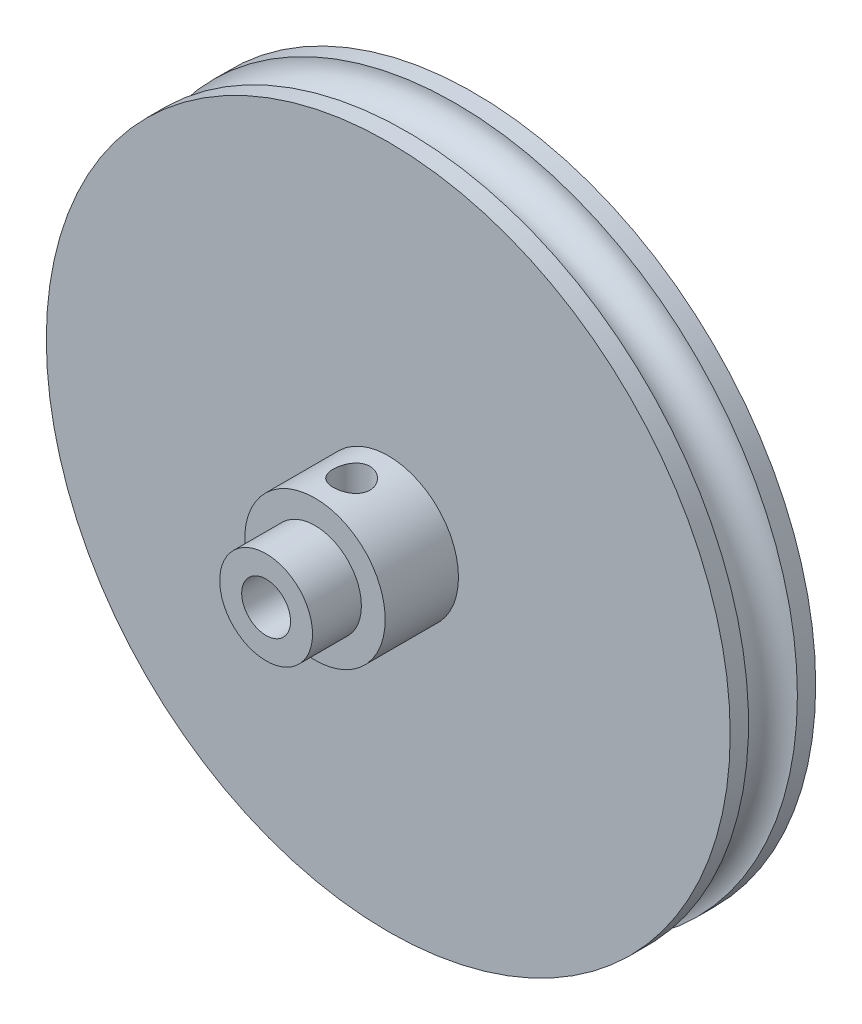
ISO-10303-21;
HEADER;
FILE_DESCRIPTION(('STEP AP214'),'2;1');
FILE_NAME('part.step','',(''),(''),'','','');
FILE_SCHEMA(('AUTOMOTIVE_DESIGN { 1 0 10303 214 1 1 1 1 }'));
ENDSEC;
DATA;
#1=APPLICATION_CONTEXT('core data for automotive mechanical design processes');
#2=APPLICATION_PROTOCOL_DEFINITION('international standard','automotive_design',2000,#1);
#3=PRODUCT_CONTEXT('',#1,'mechanical');
#4=PRODUCT('Part','Part','',(#3));
#5=PRODUCT_RELATED_PRODUCT_CATEGORY('part','',(#4));
#6=PRODUCT_DEFINITION_FORMATION('','',#4);
#7=PRODUCT_DEFINITION_CONTEXT('part definition',#1,'design');
#8=PRODUCT_DEFINITION('design','',#6,#7);
#9=PRODUCT_DEFINITION_SHAPE('','',#8);
#10=(LENGTH_UNIT() NAMED_UNIT(*) SI_UNIT(.MILLI.,.METRE.));
#11=(NAMED_UNIT(*) PLANE_ANGLE_UNIT() SI_UNIT($,.RADIAN.));
#12=(NAMED_UNIT(*) SI_UNIT($,.STERADIAN.) SOLID_ANGLE_UNIT());
#13=UNCERTAINTY_MEASURE_WITH_UNIT(LENGTH_MEASURE(1.E-05),#10,'distance_accuracy_value','');
#14=(GEOMETRIC_REPRESENTATION_CONTEXT(3) GLOBAL_UNCERTAINTY_ASSIGNED_CONTEXT((#13)) GLOBAL_UNIT_ASSIGNED_CONTEXT((#10,
#11,#12)) REPRESENTATION_CONTEXT('',''));
#15=CARTESIAN_POINT('',(0.,0.,0.));
#16=DIRECTION('',(0.,0.,1.));
#17=DIRECTION('',(1.,0.,0.));
#18=AXIS2_PLACEMENT_3D('',#15,#16,#17);
#19=CARTESIAN_POINT('',(0.,0.,0.));
#20=DIRECTION('',(0.,0.,1.));
#21=DIRECTION('',(1.,0.,0.));
#22=AXIS2_PLACEMENT_3D('',#19,#20,#21);
#23=CYLINDRICAL_SURFACE('',#22,2.);
#24=CARTESIAN_POINT('',(0.,0.,0.));
#25=DIRECTION('',(0.,0.,1.));
#26=DIRECTION('',(1.,0.,0.));
#27=AXIS2_PLACEMENT_3D('',#24,#25,#26);
#28=CIRCLE('',#27,2.);
#29=CARTESIAN_POINT('',(2.,0.,0.));
#30=VERTEX_POINT('',#29);
#31=EDGE_CURVE('E76',#30,#30,#28,.T.);
#32=ORIENTED_EDGE('',*,*,#31,.F.);
#33=EDGE_LOOP('',(#32));
#34=FACE_BOUND('',#33,.T.);
#35=CARTESIAN_POINT('',(0.,0.,17.));
#36=DIRECTION('',(0.,0.,1.));
#37=DIRECTION('',(1.,0.,0.));
#38=AXIS2_PLACEMENT_3D('',#35,#36,#37);
#39=CIRCLE('',#38,2.);
#40=CARTESIAN_POINT('',(2.,0.,17.));
#41=VERTEX_POINT('',#40);
#42=EDGE_CURVE('E64',#41,#41,#39,.T.);
#43=ORIENTED_EDGE('',*,*,#42,.T.);
#44=EDGE_LOOP('',(#43));
#45=FACE_BOUND('',#44,.T.);
#46=CARTESIAN_POINT('',(0.,2.,8.5));
#47=CARTESIAN_POINT('',(-0.0732207358411543,1.99999540196395,8.50000479201202));
#48=CARTESIAN_POINT('',(-0.146561062021485,1.99593645526274,8.5054050243745));
#49=CARTESIAN_POINT('',(-0.290936396286467,1.98006607281083,8.52666706341016));
#50=CARTESIAN_POINT('',(-0.361965136229004,1.96823514679854,8.54255517165006));
#51=CARTESIAN_POINT('',(-0.499234626631249,1.9379567495606,8.58371290928377));
#52=CARTESIAN_POINT('',(-0.565501615403736,1.91954951932009,8.60892551356918));
#53=CARTESIAN_POINT('',(-0.692422335520752,1.87750556721694,8.66754234418723));
#54=CARTESIAN_POINT('',(-0.753077701796332,1.85387037535483,8.70094417419352));
#55=CARTESIAN_POINT('',(-0.873465937590145,1.80049544543983,8.77826301159082));
#56=CARTESIAN_POINT('',(-0.932593229272032,1.77039308548439,8.82286732933407));
#57=CARTESIAN_POINT('',(-1.04302716767671,1.70767017883378,8.91949583736117));
#58=CARTESIAN_POINT('',(-1.09432148272226,1.67504578078609,8.97153148279983));
#59=CARTESIAN_POINT('',(-1.19837161436623,1.6027112365199,9.09358295327837));
#60=CARTESIAN_POINT('',(-1.24930578421204,1.56290854864639,9.1651036771217));
#61=CARTESIAN_POINT('',(-1.33861998176348,1.48711444664135,9.31745101236655));
#62=CARTESIAN_POINT('',(-1.37701716983077,1.45111786883675,9.39826469700031));
#63=CARTESIAN_POINT('',(-1.42880627811788,1.39977155180179,9.53950283867623));
#64=CARTESIAN_POINT('',(-1.44625674456539,1.38157751186733,9.59739069712838));
#65=CARTESIAN_POINT('',(-1.47420672564844,1.35171594150685,9.71639273478492));
#66=CARTESIAN_POINT('',(-1.48472215355267,1.34003347910832,9.77749917787479));
#67=CARTESIAN_POINT('',(-1.49812822141445,1.32503759684553,9.90218258553077));
#68=CARTESIAN_POINT('',(-1.50094954854207,1.32180026676597,9.96577680672405));
#69=CARTESIAN_POINT('',(-1.49848213241869,1.32459531776068,10.0926149108816));
#70=CARTESIAN_POINT('',(-1.49319048157349,1.33063102218113,10.1558586600874));
#71=CARTESIAN_POINT('',(-1.47597739291882,1.34967623262519,10.2731913474258));
#72=CARTESIAN_POINT('',(-1.46482486380817,1.36187157059871,10.3275363710462));
#73=CARTESIAN_POINT('',(-1.43705671120732,1.39114192844939,10.4334388787209));
#74=CARTESIAN_POINT('',(-1.42043583681172,1.40822163640769,10.4849936278236));
#75=CARTESIAN_POINT('',(-1.37033064172535,1.45741769294306,10.6162563866341));
#76=CARTESIAN_POINT('',(-1.3328014849398,1.49225649139233,10.6934004166435));
#77=CARTESIAN_POINT('',(-1.24618023314519,1.56533298145196,10.8391965238691));
#78=CARTESIAN_POINT('',(-1.19706004255878,1.60357878886109,10.9078273392547));
#79=CARTESIAN_POINT('',(-1.08651604102135,1.68051672313145,11.0377533904037));
#80=CARTESIAN_POINT('',(-1.02481375526037,1.71919586730239,11.0988206068815));
#81=CARTESIAN_POINT('',(-0.89042252170959,1.79248037980972,11.2102636467812));
#82=CARTESIAN_POINT('',(-0.817755054293757,1.8270934826376,11.2606599202304));
#83=CARTESIAN_POINT('',(-0.677902080454143,1.88279726073643,11.3399807992403));
#84=CARTESIAN_POINT('',(-0.61253987018562,1.90520770945008,11.3711845942158));
#85=CARTESIAN_POINT('',(-0.476352173202086,1.94372904416948,11.4242248804639));
#86=CARTESIAN_POINT('',(-0.405530141063766,1.95984387504352,11.4460672384993));
#87=CARTESIAN_POINT('',(-0.259676232483518,1.98445588635989,11.4792533628864));
#88=CARTESIAN_POINT('',(-0.184621281405943,1.99290592971749,11.4905321789386));
#89=CARTESIAN_POINT('',(-0.0332012397969171,2.00115883659445,11.5015495973717));
#90=CARTESIAN_POINT('',(0.0431632843727236,2.00096534845408,11.5012930686954));
#91=CARTESIAN_POINT('',(0.186804217329625,1.99242547175873,11.4898891307268));
#92=CARTESIAN_POINT('',(0.254222327546133,1.98490086600401,11.4798394631113));
#93=CARTESIAN_POINT('',(0.386110670609118,1.96351320201588,11.4510262199921));
#94=CARTESIAN_POINT('',(0.450580272987261,1.94964879507262,11.4322607903106));
#95=CARTESIAN_POINT('',(0.577416779689769,1.91599830683313,11.3861124694069));
#96=CARTESIAN_POINT('',(0.639629172536139,1.89602050290193,11.3584488185726));
#97=CARTESIAN_POINT('',(0.758518527043073,1.85166985411963,11.2958275445744));
#98=CARTESIAN_POINT('',(0.815194721336403,1.82729640132068,11.2608689123603));
#99=CARTESIAN_POINT('',(0.931511626319037,1.77119146886499,11.1782167535894));
#100=CARTESIAN_POINT('',(0.990066762698702,1.73891095025037,11.1293714605625));
#101=CARTESIAN_POINT('',(1.09871974855854,1.67238952874785,11.0239912474116));
#102=CARTESIAN_POINT('',(1.14879830469577,1.63814438507395,10.9674393003066));
#103=CARTESIAN_POINT('',(1.24877541075626,1.56369128291497,10.8358501190388));
#104=CARTESIAN_POINT('',(1.29683043648705,1.523587185201,10.7593424385077));
#105=CARTESIAN_POINT('',(1.37923235998283,1.4494059134845,10.5966399220275));
#106=CARTESIAN_POINT('',(1.41362000515519,1.41531099570969,10.5104748780914));
#107=CARTESIAN_POINT('',(1.45615734256767,1.37118877808583,10.3645855511255));
#108=CARTESIAN_POINT('',(1.46931009512996,1.35695811824565,10.3076088735976));
#109=CARTESIAN_POINT('',(1.48891522181906,1.33542056103011,10.1912929530168));
#110=CARTESIAN_POINT('',(1.4953825519924,1.32809821220233,10.1319592931977));
#111=CARTESIAN_POINT('',(1.50115320209064,1.32157601792209,10.0121709201887));
#112=CARTESIAN_POINT('',(1.50042015325262,1.32241740684975,9.95171205699043));
#113=CARTESIAN_POINT('',(1.49176883838219,1.33216448543666,9.83194316124784));
#114=CARTESIAN_POINT('',(1.48384130024585,1.34108058157484,9.77263471210274));
#115=CARTESIAN_POINT('',(1.45893841819723,1.36817348797773,9.6440854285892));
#116=CARTESIAN_POINT('',(1.44036567954111,1.38794705950643,9.57550281986723));
#117=CARTESIAN_POINT('',(1.39469627266119,1.4338296338541,9.44346515116952));
#118=CARTESIAN_POINT('',(1.3675780729773,1.4599546014693,9.38002355796181));
#119=CARTESIAN_POINT('',(1.29498918933643,1.52516477328824,9.23747936951367));
#120=CARTESIAN_POINT('',(1.2464154206597,1.56560203191105,9.16057841724425));
#121=CARTESIAN_POINT('',(1.13650718465936,1.64713510181273,9.01687395502244));
#122=CARTESIAN_POINT('',(1.07516134758577,1.68823146954222,8.95007953405516));
#123=CARTESIAN_POINT('',(0.939627144937894,1.76728988939793,8.82716815771667));
#124=CARTESIAN_POINT('',(0.865337161562862,1.80522333711072,8.77114368062281));
#125=CARTESIAN_POINT('',(0.705159098936206,1.87357289668097,8.67277694885465));
#126=CARTESIAN_POINT('',(0.619299420401797,1.90400691592959,8.63040202542749));
#127=CARTESIAN_POINT('',(0.464840290356458,1.94636704624048,8.57220057901429));
#128=CARTESIAN_POINT('',(0.398553614774736,1.96110322499718,8.55223326862383));
#129=CARTESIAN_POINT('',(0.262841610392764,1.98383739970238,8.52158209738851));
#130=CARTESIAN_POINT('',(0.19342562383491,1.99185421210894,8.51087230975004));
#131=CARTESIAN_POINT('',(0.102963309861892,1.99745471706309,8.50339530578565));
#132=CARTESIAN_POINT('',(0.0824069459941256,1.9984076143208,8.50212372251058));
#133=CARTESIAN_POINT('',(0.041236889624379,1.99968095423138,8.50042532676903));
#134=CARTESIAN_POINT('',(0.0206231884283885,2.00000129507253,8.49999865029263));
#135=CARTESIAN_POINT('',(0.,2.,8.5));
#136=B_SPLINE_CURVE_WITH_KNOTS('',3,(#46,#47,#48,#49,#50,#51,#52,#53,#54,#55,#56,#57,#58,#59,
#60,#61,#62,#63,#64,#65,#66,#67,#68,#69,#70,#71,#72,#73,#74,#75,#76,#77,#78,#79,#80,#81,#82,#83,
#84,#85,#86,#87,#88,#89,#90,#91,#92,#93,#94,#95,#96,#97,#98,#99,#100,#101,#102,#103,#104,#105,
#106,#107,#108,#109,#110,#111,#112,#113,#114,#115,#116,#117,#118,#119,#120,#121,#122,#123,#124,
#125,#126,#127,#128,#129,#130,#131,#132,#133,#134,#135),.UNSPECIFIED.,.T.,.F.,(4,2,2,2,2,2,2,2,
2,2,2,2,2,2,2,2,2,2,2,2,2,2,2,2,2,2,2,2,2,2,2,2,2,2,2,2,2,2,2,2,2,2,2,2,4),(0.,
0.219571786572042,0.439696319423244,0.658496333573381,0.877232398849292,1.1162243131743,
1.35558868405162,1.64360015887451,1.93121574056507,2.11999518529901,2.3083399319529,
2.49837587621257,2.6884799430021,2.85826890162709,3.0282213760064,3.3044933180591,
3.58144192357889,3.8653588393809,4.14872662493691,4.37526505006389,4.60166129643117,
4.82944058166899,5.05712372466613,5.26191187011994,5.46674360185812,5.6788043948368,
5.89089453977541,6.13840382081868,6.38646908985452,6.68168596015947,6.97601595850113,
7.15589161422933,7.33536399114209,7.51574333854741,7.69635548563854,7.91639670960134,
8.13699685139921,8.43412246655768,8.73151372390893,9.0313544949265,9.33047220273164,
9.5419569754163,9.75284752283256,9.81468166878711,9.87652576630966),.UNSPECIFIED.);
#137=CARTESIAN_POINT('',(0.,2.,8.5));
#138=VERTEX_POINT('',#137);
#139=EDGE_CURVE('E134',#138,#138,#136,.T.);
#140=ORIENTED_EDGE('',*,*,#139,.T.);
#141=EDGE_LOOP('',(#140));
#142=FACE_BOUND('',#141,.T.);
#143=ADVANCED_FACE('F41',(#34,#45,#142),#23,.F.);
#144=CARTESIAN_POINT('',(0.,0.,13.));
#145=DIRECTION('',(0.,0.,-1.));
#146=DIRECTION('',(-1.,0.,0.));
#147=AXIS2_PLACEMENT_3D('',#144,#145,#146);
#148=CYLINDRICAL_SURFACE('',#147,5.75);
#149=CARTESIAN_POINT('',(0.,0.,13.));
#150=DIRECTION('',(0.,0.,1.));
#151=DIRECTION('',(1.,0.,0.));
#152=AXIS2_PLACEMENT_3D('',#149,#150,#151);
#153=CIRCLE('',#152,5.75);
#154=CARTESIAN_POINT('',(5.75,0.,13.));
#155=VERTEX_POINT('',#154);
#156=EDGE_CURVE('E60',#155,#155,#153,.T.);
#157=ORIENTED_EDGE('',*,*,#156,.F.);
#158=EDGE_LOOP('',(#157));
#159=FACE_BOUND('',#158,.T.);
#160=CARTESIAN_POINT('',(0.,0.,7.));
#161=DIRECTION('',(0.,0.,1.));
#162=DIRECTION('',(1.,0.,0.));
#163=AXIS2_PLACEMENT_3D('',#160,#161,#162);
#164=CIRCLE('',#163,5.75);
#165=CARTESIAN_POINT('',(5.75,0.,7.));
#166=VERTEX_POINT('',#165);
#167=EDGE_CURVE('E66',#166,#166,#164,.T.);
#168=ORIENTED_EDGE('',*,*,#167,.T.);
#169=EDGE_LOOP('',(#168));
#170=FACE_BOUND('',#169,.T.);
#171=CARTESIAN_POINT('',(0.,5.75,8.5));
#172=CARTESIAN_POINT('',(0.0827565504301497,5.74999869210413,8.50000209693434));
#173=CARTESIAN_POINT('',(0.165535896333785,5.74819573678926,8.50687163655909));
#174=CARTESIAN_POINT('',(0.328714260063833,5.74117834518274,8.53412231590813));
#175=CARTESIAN_POINT('',(0.409112038400621,5.73596216398353,8.55451036662962));
#176=CARTESIAN_POINT('',(0.565147916645536,5.72269471803663,8.60809337090641));
#177=CARTESIAN_POINT('',(0.640791866299035,5.71464702139503,8.64127221128726));
#178=CARTESIAN_POINT('',(0.785441100183015,5.6965693697918,8.71943630696442));
#179=CARTESIAN_POINT('',(0.854446018094282,5.68653930554301,8.76442221322454));
#180=CARTESIAN_POINT('',(0.985395243676024,5.66533217333061,8.8659814469638));
#181=CARTESIAN_POINT('',(1.04717061891579,5.65413616833994,8.92276864635182));
#182=CARTESIAN_POINT('',(1.16043774099598,5.63198208961254,9.04586104532487));
#183=CARTESIAN_POINT('',(1.21192822336676,5.62102404527915,9.11216741351781));
#184=CARTESIAN_POINT('',(1.30397724199551,5.60039389168282,9.25375134761141));
#185=CARTESIAN_POINT('',(1.34434334141883,5.59074572831206,9.32915783233057));
#186=CARTESIAN_POINT('',(1.41175895890956,5.57410537320255,9.48597925944645));
#187=CARTESIAN_POINT('',(1.43881081557756,5.56711271508282,9.56739314377334));
#188=CARTESIAN_POINT('',(1.47824702752585,5.55677031015972,9.73205207693459));
#189=CARTESIAN_POINT('',(1.4909367764617,5.55334484273862,9.81521911320192));
#190=CARTESIAN_POINT('',(1.50224036987484,5.55029828055544,9.98256671426479));
#191=CARTESIAN_POINT('',(1.50085672263456,5.55067650786586,10.0667470957819));
#192=CARTESIAN_POINT('',(1.48429567965221,5.55512672552155,10.2313635488845));
#193=CARTESIAN_POINT('',(1.46948580722496,5.55910029308473,10.3118396759388));
#194=CARTESIAN_POINT('',(1.42708051177426,5.57013613953299,10.4691235497515));
#195=CARTESIAN_POINT('',(1.39948410614448,5.57719865579208,10.5459310140837));
#196=CARTESIAN_POINT('',(1.33198478786635,5.5937045163537,10.6946650061616));
#197=CARTESIAN_POINT('',(1.29195142735603,5.60317289375448,10.7665294381369));
#198=CARTESIAN_POINT('',(1.20080568188756,5.62340993425445,10.9026505986828));
#199=CARTESIAN_POINT('',(1.14969120122697,5.63417884314409,10.9669058846243));
#200=CARTESIAN_POINT('',(1.03594627958334,5.65621492770398,11.0880868684054));
#201=CARTESIAN_POINT('',(0.9730066664485,5.66748717408484,11.1447218365863));
#202=CARTESIAN_POINT('',(0.838386315191362,5.68895837312073,11.246691023225));
#203=CARTESIAN_POINT('',(0.766705261397836,5.69915728699075,11.2920248333949));
#204=CARTESIAN_POINT('',(0.616199144394334,5.71739102831751,11.3702252493992));
#205=CARTESIAN_POINT('',(0.537346599066203,5.72541701813719,11.4030411576181));
#206=CARTESIAN_POINT('',(0.374987203608011,5.73833660089413,11.4548683990326));
#207=CARTESIAN_POINT('',(0.291481329325966,5.74323084792075,11.473882614933));
#208=CARTESIAN_POINT('',(0.12466844814518,5.74923732985035,11.4971146775189));
#209=CARTESIAN_POINT('',(0.0414200784096534,5.75045062870886,11.5017280193963));
#210=CARTESIAN_POINT('',(-0.124660236000428,5.74924810980225,11.4971169376547));
#211=CARTESIAN_POINT('',(-0.207492220924062,5.74683264984631,11.4878938783566));
#212=CARTESIAN_POINT('',(-0.368990098986061,5.73870911781798,11.4561967953961));
#213=CARTESIAN_POINT('',(-0.447701939255478,5.73305546646209,11.4339416525768));
#214=CARTESIAN_POINT('',(-0.600268715228635,5.71909531448199,11.3770648411489));
#215=CARTESIAN_POINT('',(-0.674123135616293,5.71078853293703,11.3424418629537));
#216=CARTESIAN_POINT('',(-0.816428443616214,5.69220484598953,11.2610669954068));
#217=CARTESIAN_POINT('',(-0.884750411419281,5.68189358941189,11.2140976943347));
#218=CARTESIAN_POINT('',(-1.01268222253221,5.66049369913368,11.1096383923464));
#219=CARTESIAN_POINT('',(-1.07229041806259,5.64940491898805,11.0521464062013));
#220=CARTESIAN_POINT('',(-1.18275627994778,5.6273307326366,10.9264311721429));
#221=CARTESIAN_POINT('',(-1.23333544423787,5.61635612995624,10.8579608680037));
#222=CARTESIAN_POINT('',(-1.3222896776832,5.5960825093024,10.7132743901058));
#223=CARTESIAN_POINT('',(-1.36066527119569,5.58678341934373,10.6370585493393));
#224=CARTESIAN_POINT('',(-1.42383428632845,5.57101932883981,10.4794370807867));
#225=CARTESIAN_POINT('',(-1.44870733752349,5.5645377585197,10.398065111417));
#226=CARTESIAN_POINT('',(-1.48436197994454,5.55513419747947,10.2320970746916));
#227=CARTESIAN_POINT('',(-1.49514698498135,5.5522113444238,10.1475017935233));
#228=CARTESIAN_POINT('',(-1.50212929714525,5.55032597891716,9.98033352927471));
#229=CARTESIAN_POINT('',(-1.49877331702716,5.55124218564566,9.89778028650471));
#230=CARTESIAN_POINT('',(-1.47860023277945,5.55664900804772,9.7344606280366));
#231=CARTESIAN_POINT('',(-1.46178344725374,5.56113953912056,9.65369417009355));
#232=CARTESIAN_POINT('',(-1.41541989316566,5.57311845404139,9.49677581677364));
#233=CARTESIAN_POINT('',(-1.38596393084726,5.58058542694998,9.42059534300181));
#234=CARTESIAN_POINT('',(-1.31522905504201,5.59767724921601,9.27420105076281));
#235=CARTESIAN_POINT('',(-1.273948361164,5.6073024234757,9.20398813286678));
#236=CARTESIAN_POINT('',(-1.17936548934914,5.62796582443248,9.06938035166689));
#237=CARTESIAN_POINT('',(-1.12575664428232,5.63903628879905,9.00520588752847));
#238=CARTESIAN_POINT('',(-1.00862756716089,5.66115857831811,8.88661858880262));
#239=CARTESIAN_POINT('',(-0.94510495002805,5.67221039833667,8.83220811004711));
#240=CARTESIAN_POINT('',(-0.808402581432237,5.69331699830976,8.7336156116059));
#241=CARTESIAN_POINT('',(-0.735053640266801,5.70334712127171,8.68966247041353));
#242=CARTESIAN_POINT('',(-0.581750060014079,5.72101404443558,8.61478043939368));
#243=CARTESIAN_POINT('',(-0.50179987983651,5.72865244372007,8.58384284272776));
#244=CARTESIAN_POINT('',(-0.351741777794353,5.73963699654114,8.54010420641963));
#245=CARTESIAN_POINT('',(-0.282305646729965,5.74349538660568,8.52509918594351));
#246=CARTESIAN_POINT('',(-0.141918507101204,5.74867733519136,8.50504663119056));
#247=CARTESIAN_POINT('',(-0.0709676352972892,5.75000112158224,8.49999820178015));
#248=CARTESIAN_POINT('',(0.,5.75,8.5));
#249=B_SPLINE_CURVE_WITH_KNOTS('',3,(#171,#172,#173,#174,#175,#176,#177,#178,#179,#180,#181,
#182,#183,#184,#185,#186,#187,#188,#189,#190,#191,#192,#193,#194,#195,#196,#197,#198,#199,#200,
#201,#202,#203,#204,#205,#206,#207,#208,#209,#210,#211,#212,#213,#214,#215,#216,#217,#218,#219,
#220,#221,#222,#223,#224,#225,#226,#227,#228,#229,#230,#231,#232,#233,#234,#235,#236,#237,#238,
#239,#240,#241,#242,#243,#244,#245,#246,#247,#248),.UNSPECIFIED.,.T.,.F.,(4,2,2,2,2,2,2,2,2,2,2,
2,2,2,2,2,2,2,2,2,2,2,2,2,2,2,2,2,2,2,2,2,2,2,2,2,2,2,4),(0.,0.248009461318893,
0.496145809063828,0.743970583594285,0.991809024421142,1.24460721819603,1.49743647298028,
1.75439818241906,2.01131474130253,2.26265911775352,2.51395869822046,2.75858040416548,
3.00322091166615,3.25051934152511,3.49786458224273,3.7529160379782,4.00797670687022,
4.26405967513086,4.520089140957,4.76902239537675,5.01793110565878,5.2627745289135,
5.50764388546504,5.75715356277692,6.00671036165089,6.26297981565022,6.51923825689677,
6.7739685583984,7.02863712227793,7.27532204322615,7.52200112555968,7.76693685868474,
8.01190948996992,8.26380271891957,8.5157566426103,8.7728012919595,9.02967371503768,
9.24237261906137,9.45505239981192),.UNSPECIFIED.);
#250=CARTESIAN_POINT('',(0.,5.75,8.5));
#251=VERTEX_POINT('',#250);
#252=EDGE_CURVE('E130',#251,#251,#249,.T.);
#253=ORIENTED_EDGE('',*,*,#252,.T.);
#254=EDGE_LOOP('',(#253));
#255=FACE_BOUND('',#254,.T.);
#256=ADVANCED_FACE('F105',(#159,#170,#255),#148,.T.);
#257=CARTESIAN_POINT('',(0.,0.,7.));
#258=DIRECTION('',(0.,0.,1.));
#259=DIRECTION('',(1.,0.,0.));
#260=AXIS2_PLACEMENT_3D('',#257,#258,#259);
#261=PLANE('',#260);
#262=CARTESIAN_POINT('',(0.,0.,7.));
#263=DIRECTION('',(0.,0.,1.));
#264=DIRECTION('',(1.,0.,0.));
#265=AXIS2_PLACEMENT_3D('',#262,#263,#264);
#266=CIRCLE('',#265,28.);
#267=CARTESIAN_POINT('',(28.,0.,7.));
#268=VERTEX_POINT('',#267);
#269=EDGE_CURVE('E10',#268,#268,#266,.T.);
#270=ORIENTED_EDGE('',*,*,#269,.T.);
#271=EDGE_LOOP('',(#270));
#272=FACE_BOUND('',#271,.T.);
#273=ORIENTED_EDGE('',*,*,#167,.F.);
#274=EDGE_LOOP('',(#273));
#275=FACE_BOUND('',#274,.T.);
#276=ADVANCED_FACE('F111',(#272,#275),#261,.T.);
#277=CARTESIAN_POINT('',(0.,0.,7.));
#278=DIRECTION('',(0.,0.,-1.));
#279=DIRECTION('',(-1.,0.,0.));
#280=AXIS2_PLACEMENT_3D('',#277,#278,#279);
#281=CYLINDRICAL_SURFACE('',#280,28.);
#282=CARTESIAN_POINT('',(0.,0.,1.5));
#283=DIRECTION('',(0.,0.,1.));
#284=DIRECTION('',(1.,0.,0.));
#285=AXIS2_PLACEMENT_3D('',#282,#283,#284);
#286=CIRCLE('',#285,28.);
#287=CARTESIAN_POINT('',(28.,0.,1.5));
#288=VERTEX_POINT('',#287);
#289=EDGE_CURVE('E45',#288,#288,#286,.F.);
#290=ORIENTED_EDGE('',*,*,#289,.T.);
#291=EDGE_LOOP('',(#290));
#292=FACE_BOUND('',#291,.T.);
#293=CARTESIAN_POINT('',(0.,0.,0.));
#294=DIRECTION('',(0.,0.,1.));
#295=DIRECTION('',(1.,0.,0.));
#296=AXIS2_PLACEMENT_3D('',#293,#294,#295);
#297=CIRCLE('',#296,28.);
#298=CARTESIAN_POINT('',(28.,0.,0.));
#299=VERTEX_POINT('',#298);
#300=EDGE_CURVE('E49',#299,#299,#297,.T.);
#301=ORIENTED_EDGE('',*,*,#300,.T.);
#302=EDGE_LOOP('',(#301));
#303=FACE_BOUND('',#302,.T.);
#304=ADVANCED_FACE('F165',(#292,#303),#281,.T.);
#305=CARTESIAN_POINT('',(0.,0.,5.5));
#306=DIRECTION('',(0.,0.,-1.));
#307=DIRECTION('',(-1.,0.,0.));
#308=AXIS2_PLACEMENT_3D('',#305,#306,#307);
#309=CIRCLE('',#308,28.);
#310=CARTESIAN_POINT('',(-28.,0.,5.5));
#311=VERTEX_POINT('',#310);
#312=EDGE_CURVE('E58',#311,#311,#309,.F.);
#313=ORIENTED_EDGE('',*,*,#312,.T.);
#314=EDGE_LOOP('',(#313));
#315=FACE_BOUND('',#314,.T.);
#316=ORIENTED_EDGE('',*,*,#269,.F.);
#317=EDGE_LOOP('',(#316));
#318=FACE_BOUND('',#317,.T.);
#319=ADVANCED_FACE('F43',(#315,#318),#281,.T.);
#320=CARTESIAN_POINT('',(0.,0.,0.));
#321=DIRECTION('',(0.,0.,1.));
#322=DIRECTION('',(1.,0.,0.));
#323=AXIS2_PLACEMENT_3D('',#320,#321,#322);
#324=PLANE('',#323);
#325=ORIENTED_EDGE('',*,*,#31,.T.);
#326=EDGE_LOOP('',(#325));
#327=FACE_BOUND('',#326,.T.);
#328=ORIENTED_EDGE('',*,*,#300,.F.);
#329=EDGE_LOOP('',(#328));
#330=FACE_BOUND('',#329,.T.);
#331=ADVANCED_FACE('F93',(#327,#330),#324,.F.);
#332=CARTESIAN_POINT('',(0.,0.,17.));
#333=DIRECTION('',(0.,0.,-1.));
#334=DIRECTION('',(-1.,0.,0.));
#335=AXIS2_PLACEMENT_3D('',#332,#333,#334);
#336=CYLINDRICAL_SURFACE('',#335,3.8);
#337=CARTESIAN_POINT('',(0.,0.,13.));
#338=DIRECTION('',(0.,0.,1.));
#339=DIRECTION('',(1.,0.,0.));
#340=AXIS2_PLACEMENT_3D('',#337,#338,#339);
#341=CIRCLE('',#340,3.8);
#342=CARTESIAN_POINT('',(3.8,0.,13.));
#343=VERTEX_POINT('',#342);
#344=EDGE_CURVE('E71',#343,#343,#341,.T.);
#345=ORIENTED_EDGE('',*,*,#344,.T.);
#346=EDGE_LOOP('',(#345));
#347=FACE_BOUND('',#346,.T.);
#348=CARTESIAN_POINT('',(0.,0.,17.));
#349=DIRECTION('',(0.,0.,1.));
#350=DIRECTION('',(1.,0.,0.));
#351=AXIS2_PLACEMENT_3D('',#348,#349,#350);
#352=CIRCLE('',#351,3.8);
#353=CARTESIAN_POINT('',(3.8,0.,17.));
#354=VERTEX_POINT('',#353);
#355=EDGE_CURVE('E54',#354,#354,#352,.T.);
#356=ORIENTED_EDGE('',*,*,#355,.F.);
#357=EDGE_LOOP('',(#356));
#358=FACE_BOUND('',#357,.T.);
#359=ADVANCED_FACE('F87',(#347,#358),#336,.T.);
#360=CARTESIAN_POINT('',(0.,0.,17.));
#361=DIRECTION('',(0.,0.,1.));
#362=DIRECTION('',(1.,0.,0.));
#363=AXIS2_PLACEMENT_3D('',#360,#361,#362);
#364=PLANE('',#363);
#365=ORIENTED_EDGE('',*,*,#42,.F.);
#366=EDGE_LOOP('',(#365));
#367=FACE_BOUND('',#366,.T.);
#368=ORIENTED_EDGE('',*,*,#355,.T.);
#369=EDGE_LOOP('',(#368));
#370=FACE_BOUND('',#369,.T.);
#371=ADVANCED_FACE('F83',(#367,#370),#364,.T.);
#372=CARTESIAN_POINT('',(0.,0.,3.5));
#373=DIRECTION('',(0.,0.,-1.));
#374=DIRECTION('',(-1.,0.,0.));
#375=AXIS2_PLACEMENT_3D('',#372,#373,#374);
#376=TOROIDAL_SURFACE('',#375,28.,2.);
#377=ORIENTED_EDGE('',*,*,#312,.F.);
#378=EDGE_LOOP('',(#377));
#379=FACE_BOUND('',#378,.T.);
#380=ORIENTED_EDGE('',*,*,#289,.F.);
#381=EDGE_LOOP('',(#380));
#382=FACE_BOUND('',#381,.T.);
#383=ADVANCED_FACE('F86',(#379,#382),#376,.F.);
#384=CARTESIAN_POINT('',(0.,0.,13.));
#385=DIRECTION('',(0.,0.,1.));
#386=DIRECTION('',(1.,0.,0.));
#387=AXIS2_PLACEMENT_3D('',#384,#385,#386);
#388=PLANE('',#387);
#389=ORIENTED_EDGE('',*,*,#156,.T.);
#390=EDGE_LOOP('',(#389));
#391=FACE_BOUND('',#390,.T.);
#392=ORIENTED_EDGE('',*,*,#344,.F.);
#393=EDGE_LOOP('',(#392));
#394=FACE_BOUND('',#393,.T.);
#395=ADVANCED_FACE('F117',(#391,#394),#388,.T.);
#396=CARTESIAN_POINT('',(0.,28.001,10.));
#397=DIRECTION('',(0.,-1.,0.));
#398=DIRECTION('',(0.,0.,-1.));
#399=AXIS2_PLACEMENT_3D('',#396,#397,#398);
#400=CYLINDRICAL_SURFACE('',#399,1.5);
#401=ORIENTED_EDGE('',*,*,#252,.F.);
#402=EDGE_LOOP('',(#401));
#403=FACE_BOUND('',#402,.T.);
#404=ORIENTED_EDGE('',*,*,#139,.F.);
#405=EDGE_LOOP('',(#404));
#406=FACE_BOUND('',#405,.T.);
#407=ADVANCED_FACE('F121',(#403,#406),#400,.F.);
#408=CLOSED_SHELL('',(#143,#256,#276,#304,#319,#331,#359,#371,#383,#395,#407));
#409=MANIFOLD_SOLID_BREP('B2',#408);
#410=ADVANCED_BREP_SHAPE_REPRESENTATION('',(#18,#409),#14);
#411=SHAPE_DEFINITION_REPRESENTATION(#9,#410);
ENDSEC;
END-ISO-10303-21;
